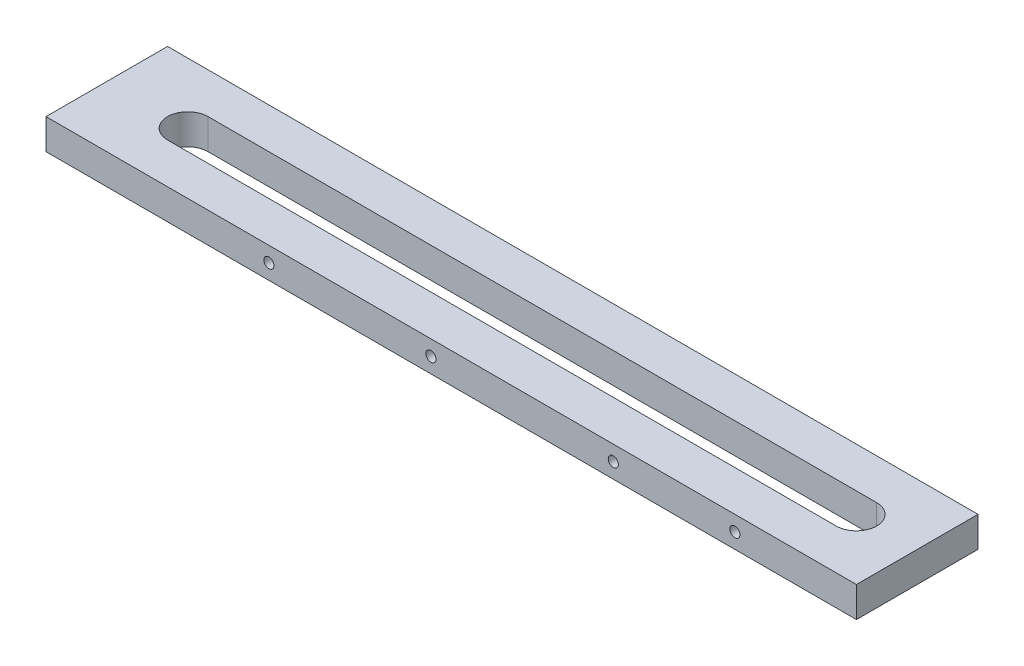
ISO-10303-21;
HEADER;
FILE_DESCRIPTION(('STEP AP214'),'2;1');
FILE_NAME('part.step','',(''),(''),'','','');
FILE_SCHEMA(('AUTOMOTIVE_DESIGN { 1 0 10303 214 1 1 1 1 }'));
ENDSEC;
DATA;
#1=APPLICATION_CONTEXT('core data for automotive mechanical design processes');
#2=APPLICATION_PROTOCOL_DEFINITION('international standard','automotive_design',2000,#1);
#3=PRODUCT_CONTEXT('',#1,'mechanical');
#4=PRODUCT('Part','Part','',(#3));
#5=PRODUCT_RELATED_PRODUCT_CATEGORY('part','',(#4));
#6=PRODUCT_DEFINITION_FORMATION('','',#4);
#7=PRODUCT_DEFINITION_CONTEXT('part definition',#1,'design');
#8=PRODUCT_DEFINITION('design','',#6,#7);
#9=PRODUCT_DEFINITION_SHAPE('','',#8);
#10=(LENGTH_UNIT() NAMED_UNIT(*) SI_UNIT(.MILLI.,.METRE.));
#11=(NAMED_UNIT(*) PLANE_ANGLE_UNIT() SI_UNIT($,.RADIAN.));
#12=(NAMED_UNIT(*) SI_UNIT($,.STERADIAN.) SOLID_ANGLE_UNIT());
#13=UNCERTAINTY_MEASURE_WITH_UNIT(LENGTH_MEASURE(1.E-05),#10,'distance_accuracy_value','');
#14=(GEOMETRIC_REPRESENTATION_CONTEXT(3) GLOBAL_UNCERTAINTY_ASSIGNED_CONTEXT((#13)) GLOBAL_UNIT_ASSIGNED_CONTEXT((#10,
#11,#12)) REPRESENTATION_CONTEXT('',''));
#15=CARTESIAN_POINT('',(0.,0.,0.));
#16=DIRECTION('',(0.,0.,1.));
#17=DIRECTION('',(1.,0.,0.));
#18=AXIS2_PLACEMENT_3D('',#15,#16,#17);
#19=CARTESIAN_POINT('',(254.,19.05,-38.1));
#20=DIRECTION('',(-1.,0.,0.));
#21=DIRECTION('',(0.,0.,1.));
#22=AXIS2_PLACEMENT_3D('',#19,#20,#21);
#23=PLANE('',#22);
#24=DIRECTION('',(0.,0.,-1.));
#25=VECTOR('',#24,1.);
#26=CARTESIAN_POINT('',(254.,0.,-38.1));
#27=LINE('',#26,#25);
#28=CARTESIAN_POINT('',(254.,0.,38.1));
#29=VERTEX_POINT('',#28);
#30=CARTESIAN_POINT('',(254.,0.,-38.1));
#31=VERTEX_POINT('',#30);
#32=EDGE_CURVE('E151',#29,#31,#27,.T.);
#33=ORIENTED_EDGE('',*,*,#32,.T.);
#34=DIRECTION('',(0.,-1.,0.));
#35=VECTOR('',#34,1.);
#36=CARTESIAN_POINT('',(254.,19.05,-38.1));
#37=LINE('',#36,#35);
#38=CARTESIAN_POINT('',(254.,19.05,-38.1));
#39=VERTEX_POINT('',#38);
#40=EDGE_CURVE('E11',#39,#31,#37,.T.);
#41=ORIENTED_EDGE('',*,*,#40,.F.);
#42=DIRECTION('',(0.,0.,-1.));
#43=VECTOR('',#42,1.);
#44=CARTESIAN_POINT('',(254.,19.05,-38.1));
#45=LINE('',#44,#43);
#46=CARTESIAN_POINT('',(254.,19.05,38.1));
#47=VERTEX_POINT('',#46);
#48=EDGE_CURVE('E157',#47,#39,#45,.T.);
#49=ORIENTED_EDGE('',*,*,#48,.F.);
#50=DIRECTION('',(0.,-1.,0.));
#51=VECTOR('',#50,1.);
#52=CARTESIAN_POINT('',(254.,19.05,38.1));
#53=LINE('',#52,#51);
#54=EDGE_CURVE('E171',#47,#29,#53,.T.);
#55=ORIENTED_EDGE('',*,*,#54,.T.);
#56=EDGE_LOOP('',(#33,#41,#49,#55));
#57=FACE_BOUND('',#56,.T.);
#58=ADVANCED_FACE('F38',(#57),#23,.F.);
#59=CARTESIAN_POINT('',(-254.,19.05,-38.1));
#60=DIRECTION('',(0.,0.,1.));
#61=DIRECTION('',(1.,0.,0.));
#62=AXIS2_PLACEMENT_3D('',#59,#60,#61);
#63=PLANE('',#62);
#64=DIRECTION('',(-1.,0.,0.));
#65=VECTOR('',#64,1.);
#66=CARTESIAN_POINT('',(-254.,0.,-38.1));
#67=LINE('',#66,#65);
#68=CARTESIAN_POINT('',(-254.,0.,-38.1));
#69=VERTEX_POINT('',#68);
#70=EDGE_CURVE('E175',#31,#69,#67,.T.);
#71=ORIENTED_EDGE('',*,*,#70,.T.);
#72=DIRECTION('',(0.,-1.,0.));
#73=VECTOR('',#72,1.);
#74=CARTESIAN_POINT('',(-254.,19.05,-38.1));
#75=LINE('',#74,#73);
#76=CARTESIAN_POINT('',(-254.,19.05,-38.1));
#77=VERTEX_POINT('',#76);
#78=EDGE_CURVE('E46',#77,#69,#75,.T.);
#79=ORIENTED_EDGE('',*,*,#78,.F.);
#80=DIRECTION('',(-1.,0.,0.));
#81=VECTOR('',#80,1.);
#82=CARTESIAN_POINT('',(-254.,19.05,-38.1));
#83=LINE('',#82,#81);
#84=EDGE_CURVE('E161',#39,#77,#83,.T.);
#85=ORIENTED_EDGE('',*,*,#84,.F.);
#86=ORIENTED_EDGE('',*,*,#40,.T.);
#87=EDGE_LOOP('',(#71,#79,#85,#86));
#88=FACE_BOUND('',#87,.T.);
#89=ADVANCED_FACE('F210',(#88),#63,.F.);
#90=CARTESIAN_POINT('',(-254.,19.05,-38.1));
#91=DIRECTION('',(1.,0.,0.));
#92=DIRECTION('',(0.,0.,-1.));
#93=AXIS2_PLACEMENT_3D('',#90,#91,#92);
#94=PLANE('',#93);
#95=DIRECTION('',(0.,0.,1.));
#96=VECTOR('',#95,1.);
#97=CARTESIAN_POINT('',(-254.,0.,-38.1));
#98=LINE('',#97,#96);
#99=CARTESIAN_POINT('',(-254.,0.,38.1));
#100=VERTEX_POINT('',#99);
#101=EDGE_CURVE('E178',#69,#100,#98,.T.);
#102=ORIENTED_EDGE('',*,*,#101,.T.);
#103=DIRECTION('',(0.,-1.,0.));
#104=VECTOR('',#103,1.);
#105=CARTESIAN_POINT('',(-254.,19.05,38.1));
#106=LINE('',#105,#104);
#107=CARTESIAN_POINT('',(-254.,19.05,38.1));
#108=VERTEX_POINT('',#107);
#109=EDGE_CURVE('E186',#108,#100,#106,.T.);
#110=ORIENTED_EDGE('',*,*,#109,.F.);
#111=DIRECTION('',(0.,0.,1.));
#112=VECTOR('',#111,1.);
#113=CARTESIAN_POINT('',(-254.,19.05,-38.1));
#114=LINE('',#113,#112);
#115=EDGE_CURVE('E165',#77,#108,#114,.T.);
#116=ORIENTED_EDGE('',*,*,#115,.F.);
#117=ORIENTED_EDGE('',*,*,#78,.T.);
#118=EDGE_LOOP('',(#102,#110,#116,#117));
#119=FACE_BOUND('',#118,.T.);
#120=ADVANCED_FACE('F196',(#119),#94,.F.);
#121=CARTESIAN_POINT('',(-254.,19.05,38.1));
#122=DIRECTION('',(0.,0.,-1.));
#123=DIRECTION('',(-1.,0.,0.));
#124=AXIS2_PLACEMENT_3D('',#121,#122,#123);
#125=PLANE('',#124);
#126=CARTESIAN_POINT('',(-114.3,9.525,38.1));
#127=DIRECTION('',(0.,0.,1.));
#128=DIRECTION('',(1.,0.,0.));
#129=AXIS2_PLACEMENT_3D('',#126,#127,#128);
#130=CIRCLE('',#129,3.175);
#131=CARTESIAN_POINT('',(-111.125,9.525,38.1));
#132=VERTEX_POINT('',#131);
#133=EDGE_CURVE('E273',#132,#132,#130,.T.);
#134=ORIENTED_EDGE('',*,*,#133,.F.);
#135=EDGE_LOOP('',(#134));
#136=FACE_BOUND('',#135,.T.);
#137=CARTESIAN_POINT('',(-12.7,9.525,38.1));
#138=DIRECTION('',(0.,0.,1.));
#139=DIRECTION('',(1.,0.,0.));
#140=AXIS2_PLACEMENT_3D('',#137,#138,#139);
#141=CIRCLE('',#140,3.175);
#142=CARTESIAN_POINT('',(-9.525,9.525,38.1));
#143=VERTEX_POINT('',#142);
#144=EDGE_CURVE('E284',#143,#143,#141,.T.);
#145=ORIENTED_EDGE('',*,*,#144,.F.);
#146=EDGE_LOOP('',(#145));
#147=FACE_BOUND('',#146,.T.);
#148=CARTESIAN_POINT('',(101.6,9.525,38.1));
#149=DIRECTION('',(0.,0.,1.));
#150=DIRECTION('',(1.,0.,0.));
#151=AXIS2_PLACEMENT_3D('',#148,#149,#150);
#152=CIRCLE('',#151,3.175);
#153=CARTESIAN_POINT('',(104.775,9.525,38.1));
#154=VERTEX_POINT('',#153);
#155=EDGE_CURVE('E292',#154,#154,#152,.T.);
#156=ORIENTED_EDGE('',*,*,#155,.F.);
#157=EDGE_LOOP('',(#156));
#158=FACE_BOUND('',#157,.T.);
#159=CARTESIAN_POINT('',(177.8,9.525,38.1));
#160=DIRECTION('',(0.,0.,1.));
#161=DIRECTION('',(1.,0.,0.));
#162=AXIS2_PLACEMENT_3D('',#159,#160,#161);
#163=CIRCLE('',#162,3.175);
#164=CARTESIAN_POINT('',(180.975,9.525,38.1));
#165=VERTEX_POINT('',#164);
#166=EDGE_CURVE('E132',#165,#165,#163,.T.);
#167=ORIENTED_EDGE('',*,*,#166,.F.);
#168=EDGE_LOOP('',(#167));
#169=FACE_BOUND('',#168,.T.);
#170=DIRECTION('',(1.,0.,0.));
#171=VECTOR('',#170,1.);
#172=CARTESIAN_POINT('',(-254.,0.,38.1));
#173=LINE('',#172,#171);
#174=EDGE_CURVE('E162',#100,#29,#173,.T.);
#175=ORIENTED_EDGE('',*,*,#174,.T.);
#176=ORIENTED_EDGE('',*,*,#54,.F.);
#177=DIRECTION('',(1.,0.,0.));
#178=VECTOR('',#177,1.);
#179=CARTESIAN_POINT('',(-254.,19.05,38.1));
#180=LINE('',#179,#178);
#181=EDGE_CURVE('E168',#108,#47,#180,.T.);
#182=ORIENTED_EDGE('',*,*,#181,.F.);
#183=ORIENTED_EDGE('',*,*,#109,.T.);
#184=EDGE_LOOP('',(#175,#176,#182,#183));
#185=FACE_BOUND('',#184,.T.);
#186=ADVANCED_FACE('F203',(#136,#147,#158,#169,#185),#125,.F.);
#187=CARTESIAN_POINT('',(0.,19.05,0.));
#188=DIRECTION('',(0.,1.,0.));
#189=DIRECTION('',(0.,0.,1.));
#190=AXIS2_PLACEMENT_3D('',#187,#188,#189);
#191=PLANE('',#190);
#192=CARTESIAN_POINT('',(-203.2,19.05,0.));
#193=DIRECTION('',(0.,1.,0.));
#194=DIRECTION('',(0.,0.,1.));
#195=AXIS2_PLACEMENT_3D('',#192,#193,#194);
#196=CIRCLE('',#195,12.7);
#197=CARTESIAN_POINT('',(-203.2,19.05,-12.7));
#198=VERTEX_POINT('',#197);
#199=CARTESIAN_POINT('',(-203.2,19.05,12.7));
#200=VERTEX_POINT('',#199);
#201=EDGE_CURVE('E53',#198,#200,#196,.T.);
#202=ORIENTED_EDGE('',*,*,#201,.F.);
#203=DIRECTION('',(-1.,0.,0.));
#204=VECTOR('',#203,1.);
#205=CARTESIAN_POINT('',(-203.2,19.05,-12.7));
#206=LINE('',#205,#204);
#207=CARTESIAN_POINT('',(215.9,19.05,-12.7));
#208=VERTEX_POINT('',#207);
#209=EDGE_CURVE('E124',#208,#198,#206,.T.);
#210=ORIENTED_EDGE('',*,*,#209,.F.);
#211=CARTESIAN_POINT('',(215.9,19.05,0.));
#212=DIRECTION('',(0.,1.,0.));
#213=DIRECTION('',(0.,0.,1.));
#214=AXIS2_PLACEMENT_3D('',#211,#212,#213);
#215=CIRCLE('',#214,12.7);
#216=CARTESIAN_POINT('',(215.9,19.05,12.7));
#217=VERTEX_POINT('',#216);
#218=EDGE_CURVE('E129',#217,#208,#215,.T.);
#219=ORIENTED_EDGE('',*,*,#218,.F.);
#220=DIRECTION('',(1.,0.,0.));
#221=VECTOR('',#220,1.);
#222=CARTESIAN_POINT('',(-203.2,19.05,12.7));
#223=LINE('',#222,#221);
#224=EDGE_CURVE('E141',#200,#217,#223,.T.);
#225=ORIENTED_EDGE('',*,*,#224,.F.);
#226=EDGE_LOOP('',(#202,#210,#219,#225));
#227=FACE_BOUND('',#226,.T.);
#228=ORIENTED_EDGE('',*,*,#48,.T.);
#229=ORIENTED_EDGE('',*,*,#84,.T.);
#230=ORIENTED_EDGE('',*,*,#115,.T.);
#231=ORIENTED_EDGE('',*,*,#181,.T.);
#232=EDGE_LOOP('',(#228,#229,#230,#231));
#233=FACE_BOUND('',#232,.T.);
#234=ADVANCED_FACE('F209',(#227,#233),#191,.T.);
#235=CARTESIAN_POINT('',(0.,0.,0.));
#236=DIRECTION('',(0.,1.,0.));
#237=DIRECTION('',(0.,0.,1.));
#238=AXIS2_PLACEMENT_3D('',#235,#236,#237);
#239=PLANE('',#238);
#240=DIRECTION('',(-1.,0.,0.));
#241=VECTOR('',#240,1.);
#242=CARTESIAN_POINT('',(-203.2,0.,-12.7));
#243=LINE('',#242,#241);
#244=CARTESIAN_POINT('',(215.9,0.,-12.7));
#245=VERTEX_POINT('',#244);
#246=CARTESIAN_POINT('',(-203.2,0.,-12.7));
#247=VERTEX_POINT('',#246);
#248=EDGE_CURVE('E112',#245,#247,#243,.T.);
#249=ORIENTED_EDGE('',*,*,#248,.T.);
#250=CARTESIAN_POINT('',(-203.2,0.,0.));
#251=DIRECTION('',(0.,1.,0.));
#252=DIRECTION('',(0.,0.,1.));
#253=AXIS2_PLACEMENT_3D('',#250,#251,#252);
#254=CIRCLE('',#253,12.7);
#255=CARTESIAN_POINT('',(-203.2,0.,12.7));
#256=VERTEX_POINT('',#255);
#257=EDGE_CURVE('E105',#247,#256,#254,.T.);
#258=ORIENTED_EDGE('',*,*,#257,.T.);
#259=DIRECTION('',(1.,0.,0.));
#260=VECTOR('',#259,1.);
#261=CARTESIAN_POINT('',(-203.2,0.,12.7));
#262=LINE('',#261,#260);
#263=CARTESIAN_POINT('',(215.9,0.,12.7));
#264=VERTEX_POINT('',#263);
#265=EDGE_CURVE('E115',#256,#264,#262,.T.);
#266=ORIENTED_EDGE('',*,*,#265,.T.);
#267=CARTESIAN_POINT('',(215.9,0.,0.));
#268=DIRECTION('',(0.,1.,0.));
#269=DIRECTION('',(0.,0.,1.));
#270=AXIS2_PLACEMENT_3D('',#267,#268,#269);
#271=CIRCLE('',#270,12.7);
#272=EDGE_CURVE('E61',#264,#245,#271,.T.);
#273=ORIENTED_EDGE('',*,*,#272,.T.);
#274=EDGE_LOOP('',(#249,#258,#266,#273));
#275=FACE_BOUND('',#274,.T.);
#276=ORIENTED_EDGE('',*,*,#32,.F.);
#277=ORIENTED_EDGE('',*,*,#174,.F.);
#278=ORIENTED_EDGE('',*,*,#101,.F.);
#279=ORIENTED_EDGE('',*,*,#70,.F.);
#280=EDGE_LOOP('',(#276,#277,#278,#279));
#281=FACE_BOUND('',#280,.T.);
#282=ADVANCED_FACE('F120',(#275,#281),#239,.F.);
#283=CARTESIAN_POINT('',(-203.2,0.,0.));
#284=DIRECTION('',(0.,1.,0.));
#285=DIRECTION('',(0.,0.,1.));
#286=AXIS2_PLACEMENT_3D('',#283,#284,#285);
#287=CYLINDRICAL_SURFACE('',#286,12.7);
#288=ORIENTED_EDGE('',*,*,#201,.T.);
#289=DIRECTION('',(0.,1.,0.));
#290=VECTOR('',#289,1.);
#291=CARTESIAN_POINT('',(-203.2,0.,12.7));
#292=LINE('',#291,#290);
#293=EDGE_CURVE('E101',#256,#200,#292,.T.);
#294=ORIENTED_EDGE('',*,*,#293,.F.);
#295=ORIENTED_EDGE('',*,*,#257,.F.);
#296=DIRECTION('',(0.,1.,0.));
#297=VECTOR('',#296,1.);
#298=CARTESIAN_POINT('',(-203.2,0.,-12.7));
#299=LINE('',#298,#297);
#300=EDGE_CURVE('E148',#247,#198,#299,.T.);
#301=ORIENTED_EDGE('',*,*,#300,.T.);
#302=EDGE_LOOP('',(#288,#294,#295,#301));
#303=FACE_BOUND('',#302,.T.);
#304=ADVANCED_FACE('F103',(#303),#287,.F.);
#305=CARTESIAN_POINT('',(-203.2,0.,-12.7));
#306=DIRECTION('',(0.,0.,-1.));
#307=DIRECTION('',(-1.,0.,0.));
#308=AXIS2_PLACEMENT_3D('',#305,#306,#307);
#309=PLANE('',#308);
#310=ORIENTED_EDGE('',*,*,#209,.T.);
#311=ORIENTED_EDGE('',*,*,#300,.F.);
#312=ORIENTED_EDGE('',*,*,#248,.F.);
#313=DIRECTION('',(0.,1.,0.));
#314=VECTOR('',#313,1.);
#315=CARTESIAN_POINT('',(215.9,0.,-12.7));
#316=LINE('',#315,#314);
#317=EDGE_CURVE('E152',#245,#208,#316,.T.);
#318=ORIENTED_EDGE('',*,*,#317,.T.);
#319=EDGE_LOOP('',(#310,#311,#312,#318));
#320=FACE_BOUND('',#319,.T.);
#321=ADVANCED_FACE('F228',(#320),#309,.F.);
#322=CARTESIAN_POINT('',(215.9,0.,0.));
#323=DIRECTION('',(0.,1.,0.));
#324=DIRECTION('',(0.,0.,1.));
#325=AXIS2_PLACEMENT_3D('',#322,#323,#324);
#326=CYLINDRICAL_SURFACE('',#325,12.7);
#327=ORIENTED_EDGE('',*,*,#218,.T.);
#328=ORIENTED_EDGE('',*,*,#317,.F.);
#329=ORIENTED_EDGE('',*,*,#272,.F.);
#330=DIRECTION('',(0.,1.,0.));
#331=VECTOR('',#330,1.);
#332=CARTESIAN_POINT('',(215.9,0.,12.7));
#333=LINE('',#332,#331);
#334=EDGE_CURVE('E111',#264,#217,#333,.T.);
#335=ORIENTED_EDGE('',*,*,#334,.T.);
#336=EDGE_LOOP('',(#327,#328,#329,#335));
#337=FACE_BOUND('',#336,.T.);
#338=ADVANCED_FACE('F232',(#337),#326,.F.);
#339=CARTESIAN_POINT('',(-203.2,0.,12.7));
#340=DIRECTION('',(0.,0.,1.));
#341=DIRECTION('',(1.,0.,0.));
#342=AXIS2_PLACEMENT_3D('',#339,#340,#341);
#343=PLANE('',#342);
#344=ORIENTED_EDGE('',*,*,#224,.T.);
#345=ORIENTED_EDGE('',*,*,#334,.F.);
#346=ORIENTED_EDGE('',*,*,#265,.F.);
#347=ORIENTED_EDGE('',*,*,#293,.T.);
#348=EDGE_LOOP('',(#344,#345,#346,#347));
#349=FACE_BOUND('',#348,.T.);
#350=ADVANCED_FACE('F116',(#349),#343,.F.);
#351=CARTESIAN_POINT('',(177.8,9.525,25.4));
#352=DIRECTION('',(0.,0.,1.));
#353=DIRECTION('',(1.,0.,0.));
#354=AXIS2_PLACEMENT_3D('',#351,#352,#353);
#355=CYLINDRICAL_SURFACE('',#354,3.175);
#356=CARTESIAN_POINT('',(177.8,9.525,25.4));
#357=DIRECTION('',(0.,0.,1.));
#358=DIRECTION('',(1.,0.,0.));
#359=AXIS2_PLACEMENT_3D('',#356,#357,#358);
#360=CIRCLE('',#359,3.175);
#361=CARTESIAN_POINT('',(180.975,9.525,25.4));
#362=VERTEX_POINT('',#361);
#363=EDGE_CURVE('E295',#362,#362,#360,.T.);
#364=ORIENTED_EDGE('',*,*,#363,.F.);
#365=EDGE_LOOP('',(#364));
#366=FACE_BOUND('',#365,.T.);
#367=ORIENTED_EDGE('',*,*,#166,.T.);
#368=EDGE_LOOP('',(#367));
#369=FACE_BOUND('',#368,.T.);
#370=ADVANCED_FACE('F231',(#366,#369),#355,.F.);
#371=CARTESIAN_POINT('',(177.8,9.525,25.4));
#372=DIRECTION('',(0.,0.,1.));
#373=DIRECTION('',(1.,0.,0.));
#374=AXIS2_PLACEMENT_3D('',#371,#372,#373);
#375=PLANE('',#374);
#376=ORIENTED_EDGE('',*,*,#363,.T.);
#377=EDGE_LOOP('',(#376));
#378=FACE_BOUND('',#377,.T.);
#379=ADVANCED_FACE('F240',(#378),#375,.T.);
#380=CARTESIAN_POINT('',(101.6,9.525,25.4));
#381=DIRECTION('',(0.,0.,1.));
#382=DIRECTION('',(1.,0.,0.));
#383=AXIS2_PLACEMENT_3D('',#380,#381,#382);
#384=CYLINDRICAL_SURFACE('',#383,3.175);
#385=CARTESIAN_POINT('',(101.6,9.525,25.4));
#386=DIRECTION('',(0.,0.,1.));
#387=DIRECTION('',(1.,0.,0.));
#388=AXIS2_PLACEMENT_3D('',#385,#386,#387);
#389=CIRCLE('',#388,3.175);
#390=CARTESIAN_POINT('',(104.775,9.525,25.4));
#391=VERTEX_POINT('',#390);
#392=EDGE_CURVE('E288',#391,#391,#389,.T.);
#393=ORIENTED_EDGE('',*,*,#392,.F.);
#394=EDGE_LOOP('',(#393));
#395=FACE_BOUND('',#394,.T.);
#396=ORIENTED_EDGE('',*,*,#155,.T.);
#397=EDGE_LOOP('',(#396));
#398=FACE_BOUND('',#397,.T.);
#399=ADVANCED_FACE('F244',(#395,#398),#384,.F.);
#400=CARTESIAN_POINT('',(101.6,9.525,25.4));
#401=DIRECTION('',(0.,0.,1.));
#402=DIRECTION('',(1.,0.,0.));
#403=AXIS2_PLACEMENT_3D('',#400,#401,#402);
#404=PLANE('',#403);
#405=ORIENTED_EDGE('',*,*,#392,.T.);
#406=EDGE_LOOP('',(#405));
#407=FACE_BOUND('',#406,.T.);
#408=ADVANCED_FACE('F248',(#407),#404,.T.);
#409=CARTESIAN_POINT('',(-12.7,9.525,25.4));
#410=DIRECTION('',(0.,0.,1.));
#411=DIRECTION('',(1.,0.,0.));
#412=AXIS2_PLACEMENT_3D('',#409,#410,#411);
#413=CYLINDRICAL_SURFACE('',#412,3.175);
#414=CARTESIAN_POINT('',(-12.7,9.525,25.4));
#415=DIRECTION('',(0.,0.,1.));
#416=DIRECTION('',(1.,0.,0.));
#417=AXIS2_PLACEMENT_3D('',#414,#415,#416);
#418=CIRCLE('',#417,3.175);
#419=CARTESIAN_POINT('',(-9.525,9.525,25.4));
#420=VERTEX_POINT('',#419);
#421=EDGE_CURVE('E278',#420,#420,#418,.T.);
#422=ORIENTED_EDGE('',*,*,#421,.F.);
#423=EDGE_LOOP('',(#422));
#424=FACE_BOUND('',#423,.T.);
#425=ORIENTED_EDGE('',*,*,#144,.T.);
#426=EDGE_LOOP('',(#425));
#427=FACE_BOUND('',#426,.T.);
#428=ADVANCED_FACE('F252',(#424,#427),#413,.F.);
#429=CARTESIAN_POINT('',(-12.7,9.525,25.4));
#430=DIRECTION('',(0.,0.,1.));
#431=DIRECTION('',(1.,0.,0.));
#432=AXIS2_PLACEMENT_3D('',#429,#430,#431);
#433=PLANE('',#432);
#434=ORIENTED_EDGE('',*,*,#421,.T.);
#435=EDGE_LOOP('',(#434));
#436=FACE_BOUND('',#435,.T.);
#437=ADVANCED_FACE('F256',(#436),#433,.T.);
#438=CARTESIAN_POINT('',(-114.3,9.525,25.4));
#439=DIRECTION('',(0.,0.,1.));
#440=DIRECTION('',(1.,0.,0.));
#441=AXIS2_PLACEMENT_3D('',#438,#439,#440);
#442=CYLINDRICAL_SURFACE('',#441,3.175);
#443=CARTESIAN_POINT('',(-114.3,9.525,25.4));
#444=DIRECTION('',(0.,0.,1.));
#445=DIRECTION('',(1.,0.,0.));
#446=AXIS2_PLACEMENT_3D('',#443,#444,#445);
#447=CIRCLE('',#446,3.175);
#448=CARTESIAN_POINT('',(-111.125,9.525,25.4));
#449=VERTEX_POINT('',#448);
#450=EDGE_CURVE('E142',#449,#449,#447,.T.);
#451=ORIENTED_EDGE('',*,*,#450,.F.);
#452=EDGE_LOOP('',(#451));
#453=FACE_BOUND('',#452,.T.);
#454=ORIENTED_EDGE('',*,*,#133,.T.);
#455=EDGE_LOOP('',(#454));
#456=FACE_BOUND('',#455,.T.);
#457=ADVANCED_FACE('F260',(#453,#456),#442,.F.);
#458=CARTESIAN_POINT('',(-114.3,9.525,25.4));
#459=DIRECTION('',(0.,0.,1.));
#460=DIRECTION('',(1.,0.,0.));
#461=AXIS2_PLACEMENT_3D('',#458,#459,#460);
#462=PLANE('',#461);
#463=ORIENTED_EDGE('',*,*,#450,.T.);
#464=EDGE_LOOP('',(#463));
#465=FACE_BOUND('',#464,.T.);
#466=ADVANCED_FACE('F264',(#465),#462,.T.);
#467=CLOSED_SHELL('',(#58,#89,#120,#186,#234,#282,#304,#321,#338,#350,#370,#379,#399,#408,#428,
#437,#457,#466));
#468=MANIFOLD_SOLID_BREP('B2',#467);
#469=ADVANCED_BREP_SHAPE_REPRESENTATION('',(#18,#468),#14);
#470=SHAPE_DEFINITION_REPRESENTATION(#9,#469);
ENDSEC;
END-ISO-10303-21;
